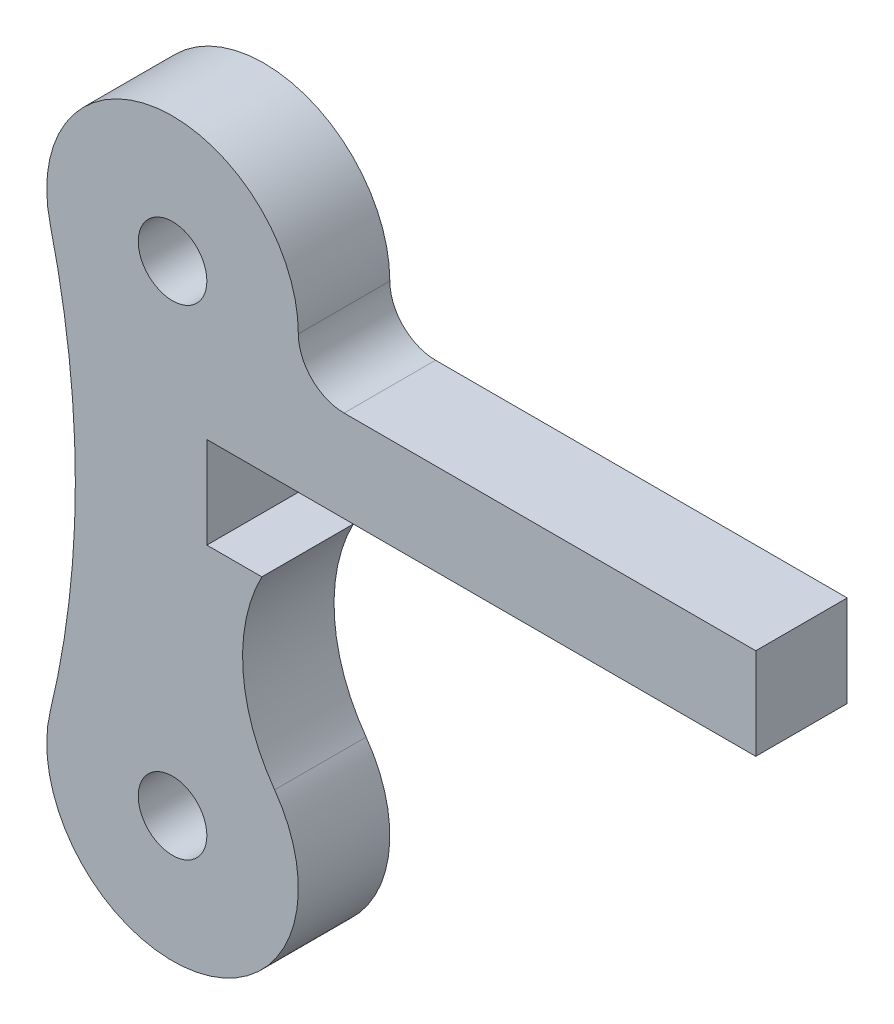
ISO-10303-21;
HEADER;
FILE_DESCRIPTION(('STEP AP214'),'2;1');
FILE_NAME('part.step','',(''),(''),'','','');
FILE_SCHEMA(('AUTOMOTIVE_DESIGN { 1 0 10303 214 1 1 1 1 }'));
ENDSEC;
DATA;
#1=APPLICATION_CONTEXT('core data for automotive mechanical design processes');
#2=APPLICATION_PROTOCOL_DEFINITION('international standard','automotive_design',2000,#1);
#3=PRODUCT_CONTEXT('',#1,'mechanical');
#4=PRODUCT('Part','Part','',(#3));
#5=PRODUCT_RELATED_PRODUCT_CATEGORY('part','',(#4));
#6=PRODUCT_DEFINITION_FORMATION('','',#4);
#7=PRODUCT_DEFINITION_CONTEXT('part definition',#1,'design');
#8=PRODUCT_DEFINITION('design','',#6,#7);
#9=PRODUCT_DEFINITION_SHAPE('','',#8);
#10=(LENGTH_UNIT() NAMED_UNIT(*) SI_UNIT(.MILLI.,.METRE.));
#11=(NAMED_UNIT(*) PLANE_ANGLE_UNIT() SI_UNIT($,.RADIAN.));
#12=(NAMED_UNIT(*) SI_UNIT($,.STERADIAN.) SOLID_ANGLE_UNIT());
#13=UNCERTAINTY_MEASURE_WITH_UNIT(LENGTH_MEASURE(1.E-05),#10,'distance_accuracy_value','');
#14=(GEOMETRIC_REPRESENTATION_CONTEXT(3) GLOBAL_UNCERTAINTY_ASSIGNED_CONTEXT((#13)) GLOBAL_UNIT_ASSIGNED_CONTEXT((#10,
#11,#12)) REPRESENTATION_CONTEXT('',''));
#15=CARTESIAN_POINT('',(0.,0.,0.));
#16=DIRECTION('',(0.,0.,1.));
#17=DIRECTION('',(1.,0.,0.));
#18=AXIS2_PLACEMENT_3D('',#15,#16,#17);
#19=CARTESIAN_POINT('',(0.,-21.,4.));
#20=DIRECTION('',(0.,0.,-1.));
#21=DIRECTION('',(-1.,0.,0.));
#22=AXIS2_PLACEMENT_3D('',#19,#20,#21);
#23=CYLINDRICAL_SURFACE('',#22,5.5);
#24=CARTESIAN_POINT('',(0.,-21.,0.));
#25=DIRECTION('',(0.,0.,1.));
#26=DIRECTION('',(1.,0.,0.));
#27=AXIS2_PLACEMENT_3D('',#24,#25,#26);
#28=CIRCLE('',#27,5.5);
#29=CARTESIAN_POINT('',(-5.34628283957518,-19.7087758524315,0.));
#30=VERTEX_POINT('',#29);
#31=CARTESIAN_POINT('',(4.46324222431669,-17.7860508953817,0.));
#32=VERTEX_POINT('',#31);
#33=EDGE_CURVE('E147',#30,#32,#28,.T.);
#34=ORIENTED_EDGE('',*,*,#33,.T.);
#35=DIRECTION('',(0.,0.,-1.));
#36=VECTOR('',#35,1.);
#37=CARTESIAN_POINT('',(4.46324222431669,-17.7860508953817,4.));
#38=LINE('',#37,#36);
#39=CARTESIAN_POINT('',(4.46324222431669,-17.7860508953817,4.));
#40=VERTEX_POINT('',#39);
#41=EDGE_CURVE('E180',#40,#32,#38,.T.);
#42=ORIENTED_EDGE('',*,*,#41,.F.);
#43=CARTESIAN_POINT('',(0.,-21.,4.));
#44=DIRECTION('',(0.,0.,1.));
#45=DIRECTION('',(1.,0.,0.));
#46=AXIS2_PLACEMENT_3D('',#43,#44,#45);
#47=CIRCLE('',#46,5.5);
#48=CARTESIAN_POINT('',(-5.34628283957518,-19.7087758524315,4.));
#49=VERTEX_POINT('',#48);
#50=EDGE_CURVE('E172',#49,#40,#47,.T.);
#51=ORIENTED_EDGE('',*,*,#50,.F.);
#52=DIRECTION('',(0.,0.,-1.));
#53=VECTOR('',#52,1.);
#54=CARTESIAN_POINT('',(-5.34628283957518,-19.7087758524315,4.));
#55=LINE('',#54,#53);
#56=EDGE_CURVE('E146',#49,#30,#55,.T.);
#57=ORIENTED_EDGE('',*,*,#56,.T.);
#58=EDGE_LOOP('',(#34,#42,#51,#57));
#59=FACE_BOUND('',#58,.T.);
#60=ADVANCED_FACE('F35',(#59),#23,.T.);
#61=CARTESIAN_POINT('',(10.5,-13.4390243902439,4.));
#62=DIRECTION('',(0.,0.,-1.));
#63=DIRECTION('',(-1.,0.,0.));
#64=AXIS2_PLACEMENT_3D('',#61,#62,#63);
#65=CYLINDRICAL_SURFACE('',#64,7.4390243902439);
#66=CARTESIAN_POINT('',(10.5,-13.4390243902439,0.));
#67=DIRECTION('',(0.,0.,1.));
#68=DIRECTION('',(1.,0.,0.));
#69=AXIS2_PLACEMENT_3D('',#66,#67,#68);
#70=CIRCLE('',#69,7.4390243902439);
#71=CARTESIAN_POINT('',(3.90362257584125,-10.,0.));
#72=VERTEX_POINT('',#71);
#73=EDGE_CURVE('E150',#32,#72,#70,.F.);
#74=ORIENTED_EDGE('',*,*,#73,.T.);
#75=DIRECTION('',(0.,0.,-1.));
#76=VECTOR('',#75,1.);
#77=CARTESIAN_POINT('',(3.90362257584125,-10.,4.));
#78=LINE('',#77,#76);
#79=CARTESIAN_POINT('',(3.90362257584125,-10.,4.));
#80=VERTEX_POINT('',#79);
#81=EDGE_CURVE('E49',#72,#80,#78,.F.);
#82=ORIENTED_EDGE('',*,*,#81,.T.);
#83=CARTESIAN_POINT('',(10.5,-13.4390243902439,4.));
#84=DIRECTION('',(0.,0.,1.));
#85=DIRECTION('',(1.,0.,0.));
#86=AXIS2_PLACEMENT_3D('',#83,#84,#85);
#87=CIRCLE('',#86,7.4390243902439);
#88=EDGE_CURVE('E96',#40,#80,#87,.F.);
#89=ORIENTED_EDGE('',*,*,#88,.F.);
#90=ORIENTED_EDGE('',*,*,#41,.T.);
#91=EDGE_LOOP('',(#74,#82,#89,#90));
#92=FACE_BOUND('',#91,.T.);
#93=ADVANCED_FACE('F190',(#92),#65,.F.);
#94=CARTESIAN_POINT('',(0.,-6.,4.));
#95=DIRECTION('',(0.,1.,0.));
#96=DIRECTION('',(-1.,0.,0.));
#97=AXIS2_PLACEMENT_3D('',#94,#95,#96);
#98=PLANE('',#97);
#99=DIRECTION('',(1.,0.,0.));
#100=VECTOR('',#99,1.);
#101=CARTESIAN_POINT('',(0.,-6.,0.));
#102=LINE('',#101,#100);
#103=CARTESIAN_POINT('',(1.5,-6.,0.));
#104=VERTEX_POINT('',#103);
#105=CARTESIAN_POINT('',(25.5,-6.,0.));
#106=VERTEX_POINT('',#105);
#107=EDGE_CURVE('E153',#104,#106,#102,.T.);
#108=ORIENTED_EDGE('',*,*,#107,.T.);
#109=DIRECTION('',(0.,0.,-1.));
#110=VECTOR('',#109,1.);
#111=CARTESIAN_POINT('',(25.5,-6.,4.));
#112=LINE('',#111,#110);
#113=CARTESIAN_POINT('',(25.5,-6.,4.));
#114=VERTEX_POINT('',#113);
#115=EDGE_CURVE('E178',#114,#106,#112,.T.);
#116=ORIENTED_EDGE('',*,*,#115,.F.);
#117=DIRECTION('',(1.,0.,0.));
#118=VECTOR('',#117,1.);
#119=CARTESIAN_POINT('',(0.,-6.,4.));
#120=LINE('',#119,#118);
#121=CARTESIAN_POINT('',(1.5,-6.,4.));
#122=VERTEX_POINT('',#121);
#123=EDGE_CURVE('E197',#122,#114,#120,.T.);
#124=ORIENTED_EDGE('',*,*,#123,.F.);
#125=DIRECTION('',(0.,0.,1.));
#126=VECTOR('',#125,1.);
#127=CARTESIAN_POINT('',(1.5,-6.,-6.));
#128=LINE('',#127,#126);
#129=EDGE_CURVE('E218',#104,#122,#128,.T.);
#130=ORIENTED_EDGE('',*,*,#129,.F.);
#131=EDGE_LOOP('',(#108,#116,#124,#130));
#132=FACE_BOUND('',#131,.T.);
#133=ADVANCED_FACE('F220',(#132),#98,.F.);
#134=CARTESIAN_POINT('',(25.5,0.,4.));
#135=DIRECTION('',(1.,0.,0.));
#136=DIRECTION('',(0.,0.,-1.));
#137=AXIS2_PLACEMENT_3D('',#134,#135,#136);
#138=PLANE('',#137);
#139=DIRECTION('',(0.,-1.,0.));
#140=VECTOR('',#139,1.);
#141=CARTESIAN_POINT('',(25.5,0.,0.));
#142=LINE('',#141,#140);
#143=CARTESIAN_POINT('',(25.5,-2.,0.));
#144=VERTEX_POINT('',#143);
#145=EDGE_CURVE('E156',#144,#106,#142,.T.);
#146=ORIENTED_EDGE('',*,*,#145,.F.);
#147=DIRECTION('',(0.,0.,-1.));
#148=VECTOR('',#147,1.);
#149=CARTESIAN_POINT('',(25.5,-2.,4.));
#150=LINE('',#149,#148);
#151=CARTESIAN_POINT('',(25.5,-2.,4.));
#152=VERTEX_POINT('',#151);
#153=EDGE_CURVE('E176',#152,#144,#150,.T.);
#154=ORIENTED_EDGE('',*,*,#153,.F.);
#155=DIRECTION('',(0.,-1.,0.));
#156=VECTOR('',#155,1.);
#157=CARTESIAN_POINT('',(25.5,0.,4.));
#158=LINE('',#157,#156);
#159=EDGE_CURVE('E135',#152,#114,#158,.T.);
#160=ORIENTED_EDGE('',*,*,#159,.T.);
#161=ORIENTED_EDGE('',*,*,#115,.T.);
#162=EDGE_LOOP('',(#146,#154,#160,#161));
#163=FACE_BOUND('',#162,.T.);
#164=ADVANCED_FACE('F205',(#163),#138,.T.);
#165=CARTESIAN_POINT('',(0.,-2.,4.));
#166=DIRECTION('',(0.,1.,0.));
#167=DIRECTION('',(0.,0.,1.));
#168=AXIS2_PLACEMENT_3D('',#165,#166,#167);
#169=PLANE('',#168);
#170=DIRECTION('',(1.,0.,0.));
#171=VECTOR('',#170,1.);
#172=CARTESIAN_POINT('',(0.,-2.,0.));
#173=LINE('',#172,#171);
#174=CARTESIAN_POINT('',(7.5,-2.,0.));
#175=VERTEX_POINT('',#174);
#176=EDGE_CURVE('E159',#175,#144,#173,.T.);
#177=ORIENTED_EDGE('',*,*,#176,.F.);
#178=DIRECTION('',(0.,0.,-1.));
#179=VECTOR('',#178,1.);
#180=CARTESIAN_POINT('',(7.5,-2.,4.));
#181=LINE('',#180,#179);
#182=CARTESIAN_POINT('',(7.5,-2.,4.));
#183=VERTEX_POINT('',#182);
#184=EDGE_CURVE('E120',#183,#175,#181,.T.);
#185=ORIENTED_EDGE('',*,*,#184,.F.);
#186=DIRECTION('',(1.,0.,0.));
#187=VECTOR('',#186,1.);
#188=CARTESIAN_POINT('',(0.,-2.,4.));
#189=LINE('',#188,#187);
#190=EDGE_CURVE('E133',#183,#152,#189,.T.);
#191=ORIENTED_EDGE('',*,*,#190,.T.);
#192=ORIENTED_EDGE('',*,*,#153,.T.);
#193=EDGE_LOOP('',(#177,#185,#191,#192));
#194=FACE_BOUND('',#193,.T.);
#195=ADVANCED_FACE('F210',(#194),#169,.T.);
#196=CARTESIAN_POINT('',(7.5,0.,4.));
#197=DIRECTION('',(0.,0.,-1.));
#198=DIRECTION('',(-1.,0.,0.));
#199=AXIS2_PLACEMENT_3D('',#196,#197,#198);
#200=CYLINDRICAL_SURFACE('',#199,2.);
#201=CARTESIAN_POINT('',(7.5,0.,0.));
#202=DIRECTION('',(0.,0.,1.));
#203=DIRECTION('',(1.,0.,0.));
#204=AXIS2_PLACEMENT_3D('',#201,#202,#203);
#205=CIRCLE('',#204,2.);
#206=CARTESIAN_POINT('',(5.5,0.,0.));
#207=VERTEX_POINT('',#206);
#208=EDGE_CURVE('E117',#207,#175,#205,.T.);
#209=ORIENTED_EDGE('',*,*,#208,.F.);
#210=DIRECTION('',(0.,0.,-1.));
#211=VECTOR('',#210,1.);
#212=CARTESIAN_POINT('',(5.5,0.,4.));
#213=LINE('',#212,#211);
#214=CARTESIAN_POINT('',(5.5,0.,4.));
#215=VERTEX_POINT('',#214);
#216=EDGE_CURVE('E111',#215,#207,#213,.T.);
#217=ORIENTED_EDGE('',*,*,#216,.F.);
#218=CARTESIAN_POINT('',(7.5,0.,4.));
#219=DIRECTION('',(0.,0.,1.));
#220=DIRECTION('',(1.,0.,0.));
#221=AXIS2_PLACEMENT_3D('',#218,#219,#220);
#222=CIRCLE('',#221,2.);
#223=EDGE_CURVE('E115',#215,#183,#222,.T.);
#224=ORIENTED_EDGE('',*,*,#223,.T.);
#225=ORIENTED_EDGE('',*,*,#184,.T.);
#226=EDGE_LOOP('',(#209,#217,#224,#225));
#227=FACE_BOUND('',#226,.T.);
#228=ADVANCED_FACE('F113',(#227),#200,.F.);
#229=CARTESIAN_POINT('',(0.,0.,4.));
#230=DIRECTION('',(0.,0.,-1.));
#231=DIRECTION('',(-1.,0.,0.));
#232=AXIS2_PLACEMENT_3D('',#229,#230,#231);
#233=CYLINDRICAL_SURFACE('',#232,5.5);
#234=CARTESIAN_POINT('',(0.,0.,0.));
#235=DIRECTION('',(0.,0.,1.));
#236=DIRECTION('',(1.,0.,0.));
#237=AXIS2_PLACEMENT_3D('',#234,#235,#236);
#238=CIRCLE('',#237,5.5);
#239=CARTESIAN_POINT('',(-5.34628283957518,-1.29122414756847,0.));
#240=VERTEX_POINT('',#239);
#241=EDGE_CURVE('E163',#207,#240,#238,.T.);
#242=ORIENTED_EDGE('',*,*,#241,.T.);
#243=DIRECTION('',(0.,0.,-1.));
#244=VECTOR('',#243,1.);
#245=CARTESIAN_POINT('',(-5.34628283957518,-1.29122414756847,4.));
#246=LINE('',#245,#244);
#247=CARTESIAN_POINT('',(-5.34628283957518,-1.29122414756847,4.));
#248=VERTEX_POINT('',#247);
#249=EDGE_CURVE('E121',#248,#240,#246,.T.);
#250=ORIENTED_EDGE('',*,*,#249,.F.);
#251=CARTESIAN_POINT('',(0.,0.,4.));
#252=DIRECTION('',(0.,0.,1.));
#253=DIRECTION('',(1.,0.,0.));
#254=AXIS2_PLACEMENT_3D('',#251,#252,#253);
#255=CIRCLE('',#254,5.5);
#256=EDGE_CURVE('E124',#215,#248,#255,.T.);
#257=ORIENTED_EDGE('',*,*,#256,.F.);
#258=ORIENTED_EDGE('',*,*,#216,.T.);
#259=EDGE_LOOP('',(#242,#250,#257,#258));
#260=FACE_BOUND('',#259,.T.);
#261=ADVANCED_FACE('F125',(#260),#233,.T.);
#262=CARTESIAN_POINT('',(0.,0.,4.));
#263=DIRECTION('',(0.,0.,-1.));
#264=DIRECTION('',(-1.,0.,0.));
#265=AXIS2_PLACEMENT_3D('',#262,#263,#264);
#266=CYLINDRICAL_SURFACE('',#265,1.5);
#267=CARTESIAN_POINT('',(0.,0.,4.));
#268=DIRECTION('',(0.,0.,1.));
#269=DIRECTION('',(1.,0.,0.));
#270=AXIS2_PLACEMENT_3D('',#267,#268,#269);
#271=CIRCLE('',#270,1.5);
#272=CARTESIAN_POINT('',(1.5,0.,4.));
#273=VERTEX_POINT('',#272);
#274=EDGE_CURVE('E140',#273,#273,#271,.T.);
#275=ORIENTED_EDGE('',*,*,#274,.T.);
#276=EDGE_LOOP('',(#275));
#277=FACE_BOUND('',#276,.T.);
#278=CARTESIAN_POINT('',(0.,0.,0.));
#279=DIRECTION('',(0.,0.,1.));
#280=DIRECTION('',(1.,0.,0.));
#281=AXIS2_PLACEMENT_3D('',#278,#279,#280);
#282=CIRCLE('',#281,1.5);
#283=CARTESIAN_POINT('',(1.5,0.,0.));
#284=VERTEX_POINT('',#283);
#285=EDGE_CURVE('E166',#284,#284,#282,.T.);
#286=ORIENTED_EDGE('',*,*,#285,.F.);
#287=EDGE_LOOP('',(#286));
#288=FACE_BOUND('',#287,.T.);
#289=ADVANCED_FACE('F255',(#277,#288),#266,.F.);
#290=CARTESIAN_POINT('',(-43.475,-10.5,4.));
#291=DIRECTION('',(0.,0.,-1.));
#292=DIRECTION('',(-1.,0.,0.));
#293=AXIS2_PLACEMENT_3D('',#290,#291,#292);
#294=CYLINDRICAL_SURFACE('',#293,39.225);
#295=CARTESIAN_POINT('',(-43.475,-10.5,0.));
#296=DIRECTION('',(0.,0.,1.));
#297=DIRECTION('',(1.,0.,0.));
#298=AXIS2_PLACEMENT_3D('',#295,#296,#297);
#299=CIRCLE('',#298,39.225);
#300=EDGE_CURVE('E88',#240,#30,#299,.F.);
#301=ORIENTED_EDGE('',*,*,#300,.T.);
#302=ORIENTED_EDGE('',*,*,#56,.F.);
#303=CARTESIAN_POINT('',(-43.475,-10.5,4.));
#304=DIRECTION('',(0.,0.,1.));
#305=DIRECTION('',(1.,0.,0.));
#306=AXIS2_PLACEMENT_3D('',#303,#304,#305);
#307=CIRCLE('',#306,39.225);
#308=EDGE_CURVE('E58',#248,#49,#307,.F.);
#309=ORIENTED_EDGE('',*,*,#308,.F.);
#310=ORIENTED_EDGE('',*,*,#249,.T.);
#311=EDGE_LOOP('',(#301,#302,#309,#310));
#312=FACE_BOUND('',#311,.T.);
#313=ADVANCED_FACE('F195',(#312),#294,.F.);
#314=CARTESIAN_POINT('',(0.,-21.,4.));
#315=DIRECTION('',(0.,0.,-1.));
#316=DIRECTION('',(-1.,0.,0.));
#317=AXIS2_PLACEMENT_3D('',#314,#315,#316);
#318=CYLINDRICAL_SURFACE('',#317,1.5);
#319=CARTESIAN_POINT('',(0.,-21.,4.));
#320=DIRECTION('',(0.,0.,1.));
#321=DIRECTION('',(1.,0.,0.));
#322=AXIS2_PLACEMENT_3D('',#319,#320,#321);
#323=CIRCLE('',#322,1.5);
#324=CARTESIAN_POINT('',(1.50000000000001,-21.,4.));
#325=VERTEX_POINT('',#324);
#326=EDGE_CURVE('E143',#325,#325,#323,.T.);
#327=ORIENTED_EDGE('',*,*,#326,.T.);
#328=EDGE_LOOP('',(#327));
#329=FACE_BOUND('',#328,.T.);
#330=CARTESIAN_POINT('',(0.,-21.,0.));
#331=DIRECTION('',(0.,0.,1.));
#332=DIRECTION('',(1.,0.,0.));
#333=AXIS2_PLACEMENT_3D('',#330,#331,#332);
#334=CIRCLE('',#333,1.5);
#335=CARTESIAN_POINT('',(1.50000000000001,-21.,0.));
#336=VERTEX_POINT('',#335);
#337=EDGE_CURVE('E169',#336,#336,#334,.T.);
#338=ORIENTED_EDGE('',*,*,#337,.F.);
#339=EDGE_LOOP('',(#338));
#340=FACE_BOUND('',#339,.T.);
#341=ADVANCED_FACE('F258',(#329,#340),#318,.F.);
#342=CARTESIAN_POINT('',(0.,0.,4.));
#343=DIRECTION('',(0.,0.,1.));
#344=DIRECTION('',(1.,0.,0.));
#345=AXIS2_PLACEMENT_3D('',#342,#343,#344);
#346=PLANE('',#345);
#347=DIRECTION('',(0.,-1.,0.));
#348=VECTOR('',#347,1.);
#349=CARTESIAN_POINT('',(1.5,-6.,4.));
#350=LINE('',#349,#348);
#351=CARTESIAN_POINT('',(1.5,-10.,4.));
#352=VERTEX_POINT('',#351);
#353=EDGE_CURVE('E225',#122,#352,#350,.T.);
#354=ORIENTED_EDGE('',*,*,#353,.F.);
#355=ORIENTED_EDGE('',*,*,#123,.T.);
#356=ORIENTED_EDGE('',*,*,#159,.F.);
#357=ORIENTED_EDGE('',*,*,#190,.F.);
#358=ORIENTED_EDGE('',*,*,#223,.F.);
#359=ORIENTED_EDGE('',*,*,#256,.T.);
#360=ORIENTED_EDGE('',*,*,#308,.T.);
#361=ORIENTED_EDGE('',*,*,#50,.T.);
#362=ORIENTED_EDGE('',*,*,#88,.T.);
#363=DIRECTION('',(1.,0.,0.));
#364=VECTOR('',#363,1.);
#365=CARTESIAN_POINT('',(1.5,-10.,4.));
#366=LINE('',#365,#364);
#367=EDGE_CURVE('E222',#352,#80,#366,.T.);
#368=ORIENTED_EDGE('',*,*,#367,.F.);
#369=EDGE_LOOP('',(#354,#355,#356,#357,#358,#359,#360,#361,#362,#368));
#370=FACE_BOUND('',#369,.T.);
#371=ORIENTED_EDGE('',*,*,#274,.F.);
#372=EDGE_LOOP('',(#371));
#373=FACE_BOUND('',#372,.T.);
#374=ORIENTED_EDGE('',*,*,#326,.F.);
#375=EDGE_LOOP('',(#374));
#376=FACE_BOUND('',#375,.T.);
#377=ADVANCED_FACE('F129',(#370,#373,#376),#346,.T.);
#378=CARTESIAN_POINT('',(0.,0.,0.));
#379=DIRECTION('',(0.,0.,1.));
#380=DIRECTION('',(1.,0.,0.));
#381=AXIS2_PLACEMENT_3D('',#378,#379,#380);
#382=PLANE('',#381);
#383=ORIENTED_EDGE('',*,*,#107,.F.);
#384=DIRECTION('',(0.,-1.,0.));
#385=VECTOR('',#384,1.);
#386=CARTESIAN_POINT('',(1.5,0.,0.));
#387=LINE('',#386,#385);
#388=CARTESIAN_POINT('',(1.5,-10.,0.));
#389=VERTEX_POINT('',#388);
#390=EDGE_CURVE('E11',#104,#389,#387,.T.);
#391=ORIENTED_EDGE('',*,*,#390,.T.);
#392=DIRECTION('',(1.,0.,0.));
#393=VECTOR('',#392,1.);
#394=CARTESIAN_POINT('',(0.,-10.,0.));
#395=LINE('',#394,#393);
#396=EDGE_CURVE('E42',#389,#72,#395,.T.);
#397=ORIENTED_EDGE('',*,*,#396,.T.);
#398=ORIENTED_EDGE('',*,*,#73,.F.);
#399=ORIENTED_EDGE('',*,*,#33,.F.);
#400=ORIENTED_EDGE('',*,*,#300,.F.);
#401=ORIENTED_EDGE('',*,*,#241,.F.);
#402=ORIENTED_EDGE('',*,*,#208,.T.);
#403=ORIENTED_EDGE('',*,*,#176,.T.);
#404=ORIENTED_EDGE('',*,*,#145,.T.);
#405=EDGE_LOOP('',(#383,#391,#397,#398,#399,#400,#401,#402,#403,#404));
#406=FACE_BOUND('',#405,.T.);
#407=ORIENTED_EDGE('',*,*,#285,.T.);
#408=EDGE_LOOP('',(#407));
#409=FACE_BOUND('',#408,.T.);
#410=ORIENTED_EDGE('',*,*,#337,.T.);
#411=EDGE_LOOP('',(#410));
#412=FACE_BOUND('',#411,.T.);
#413=ADVANCED_FACE('F183',(#406,#409,#412),#382,.F.);
#414=CARTESIAN_POINT('',(1.5,-6.,-6.));
#415=DIRECTION('',(-1.,0.,0.));
#416=DIRECTION('',(0.,-1.,0.));
#417=AXIS2_PLACEMENT_3D('',#414,#415,#416);
#418=PLANE('',#417);
#419=ORIENTED_EDGE('',*,*,#129,.T.);
#420=ORIENTED_EDGE('',*,*,#353,.T.);
#421=DIRECTION('',(0.,0.,1.));
#422=VECTOR('',#421,1.);
#423=CARTESIAN_POINT('',(1.5,-10.,-6.));
#424=LINE('',#423,#422);
#425=EDGE_CURVE('E219',#389,#352,#424,.T.);
#426=ORIENTED_EDGE('',*,*,#425,.F.);
#427=ORIENTED_EDGE('',*,*,#390,.F.);
#428=EDGE_LOOP('',(#419,#420,#426,#427));
#429=FACE_BOUND('',#428,.T.);
#430=ADVANCED_FACE('F215',(#429),#418,.F.);
#431=CARTESIAN_POINT('',(1.5,-10.,-6.));
#432=DIRECTION('',(0.,-1.,0.));
#433=DIRECTION('',(0.,0.,-1.));
#434=AXIS2_PLACEMENT_3D('',#431,#432,#433);
#435=PLANE('',#434);
#436=ORIENTED_EDGE('',*,*,#396,.F.);
#437=ORIENTED_EDGE('',*,*,#425,.T.);
#438=ORIENTED_EDGE('',*,*,#367,.T.);
#439=ORIENTED_EDGE('',*,*,#81,.F.);
#440=EDGE_LOOP('',(#436,#437,#438,#439));
#441=FACE_BOUND('',#440,.T.);
#442=ADVANCED_FACE('F229',(#441),#435,.F.);
#443=CLOSED_SHELL('',(#60,#93,#133,#164,#195,#228,#261,#289,#313,#341,#377,#413,#430,#442));
#444=MANIFOLD_SOLID_BREP('B2',#443);
#445=ADVANCED_BREP_SHAPE_REPRESENTATION('',(#18,#444),#14);
#446=SHAPE_DEFINITION_REPRESENTATION(#9,#445);
ENDSEC;
END-ISO-10303-21;
